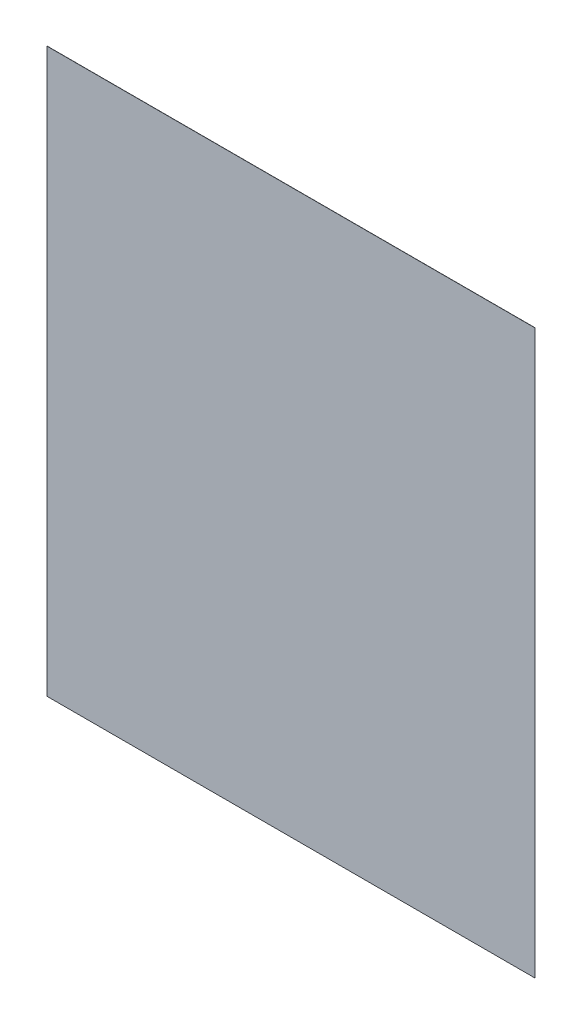
ISO-10303-21;
HEADER;
FILE_DESCRIPTION(('STEP AP214'),'2;1');
FILE_NAME('part.step','',(''),(''),'','','');
FILE_SCHEMA(('AUTOMOTIVE_DESIGN { 1 0 10303 214 1 1 1 1 }'));
ENDSEC;
DATA;
#1=APPLICATION_CONTEXT('core data for automotive mechanical design processes');
#2=APPLICATION_PROTOCOL_DEFINITION('international standard','automotive_design',2000,#1);
#3=PRODUCT_CONTEXT('',#1,'mechanical');
#4=PRODUCT('Part','Part','',(#3));
#5=PRODUCT_RELATED_PRODUCT_CATEGORY('part','',(#4));
#6=PRODUCT_DEFINITION_FORMATION('','',#4);
#7=PRODUCT_DEFINITION_CONTEXT('part definition',#1,'design');
#8=PRODUCT_DEFINITION('design','',#6,#7);
#9=PRODUCT_DEFINITION_SHAPE('','',#8);
#10=(LENGTH_UNIT() NAMED_UNIT(*) SI_UNIT(.MILLI.,.METRE.));
#11=(NAMED_UNIT(*) PLANE_ANGLE_UNIT() SI_UNIT($,.RADIAN.));
#12=(NAMED_UNIT(*) SI_UNIT($,.STERADIAN.) SOLID_ANGLE_UNIT());
#13=UNCERTAINTY_MEASURE_WITH_UNIT(LENGTH_MEASURE(1.E-05),#10,'distance_accuracy_value','');
#14=(GEOMETRIC_REPRESENTATION_CONTEXT(3) GLOBAL_UNCERTAINTY_ASSIGNED_CONTEXT((#13)) GLOBAL_UNIT_ASSIGNED_CONTEXT((#10,
#11,#12)) REPRESENTATION_CONTEXT('',''));
#15=CARTESIAN_POINT('',(0.,0.,0.));
#16=DIRECTION('',(0.,0.,1.));
#17=DIRECTION('',(1.,0.,0.));
#18=AXIS2_PLACEMENT_3D('',#15,#16,#17);
#19=CARTESIAN_POINT('',(-130.,-150.,0.1));
#20=DIRECTION('',(1.,0.,0.));
#21=DIRECTION('',(0.,0.,-1.));
#22=AXIS2_PLACEMENT_3D('',#19,#20,#21);
#23=PLANE('',#22);
#24=DIRECTION('',(0.,-1.,0.));
#25=VECTOR('',#24,1.);
#26=CARTESIAN_POINT('',(-130.,-150.,0.));
#27=LINE('',#26,#25);
#28=CARTESIAN_POINT('',(-130.,150.,0.));
#29=VERTEX_POINT('',#28);
#30=CARTESIAN_POINT('',(-130.,-150.,0.));
#31=VERTEX_POINT('',#30);
#32=EDGE_CURVE('E102',#29,#31,#27,.T.);
#33=ORIENTED_EDGE('',*,*,#32,.T.);
#34=DIRECTION('',(0.,0.,-1.));
#35=VECTOR('',#34,1.);
#36=CARTESIAN_POINT('',(-130.,-150.,0.1));
#37=LINE('',#36,#35);
#38=CARTESIAN_POINT('',(-130.,-150.,0.1));
#39=VERTEX_POINT('',#38);
#40=EDGE_CURVE('E11',#39,#31,#37,.T.);
#41=ORIENTED_EDGE('',*,*,#40,.F.);
#42=DIRECTION('',(0.,-1.,0.));
#43=VECTOR('',#42,1.);
#44=CARTESIAN_POINT('',(-130.,-150.,0.1));
#45=LINE('',#44,#43);
#46=CARTESIAN_POINT('',(-130.,150.,0.1));
#47=VERTEX_POINT('',#46);
#48=EDGE_CURVE('E90',#47,#39,#45,.T.);
#49=ORIENTED_EDGE('',*,*,#48,.F.);
#50=DIRECTION('',(0.,0.,-1.));
#51=VECTOR('',#50,1.);
#52=CARTESIAN_POINT('',(-130.,150.,0.1));
#53=LINE('',#52,#51);
#54=EDGE_CURVE('E98',#47,#29,#53,.T.);
#55=ORIENTED_EDGE('',*,*,#54,.T.);
#56=EDGE_LOOP('',(#33,#41,#49,#55));
#57=FACE_BOUND('',#56,.T.);
#58=ADVANCED_FACE('F39',(#57),#23,.F.);
#59=CARTESIAN_POINT('',(130.,-150.,0.1));
#60=DIRECTION('',(0.,1.,0.));
#61=DIRECTION('',(0.,0.,1.));
#62=AXIS2_PLACEMENT_3D('',#59,#60,#61);
#63=PLANE('',#62);
#64=DIRECTION('',(1.,0.,0.));
#65=VECTOR('',#64,1.);
#66=CARTESIAN_POINT('',(130.,-150.,0.));
#67=LINE('',#66,#65);
#68=CARTESIAN_POINT('',(130.,-150.,0.));
#69=VERTEX_POINT('',#68);
#70=EDGE_CURVE('E94',#31,#69,#67,.T.);
#71=ORIENTED_EDGE('',*,*,#70,.T.);
#72=DIRECTION('',(0.,0.,-1.));
#73=VECTOR('',#72,1.);
#74=CARTESIAN_POINT('',(130.,-150.,0.1));
#75=LINE('',#74,#73);
#76=CARTESIAN_POINT('',(130.,-150.,0.1));
#77=VERTEX_POINT('',#76);
#78=EDGE_CURVE('E47',#77,#69,#75,.T.);
#79=ORIENTED_EDGE('',*,*,#78,.F.);
#80=DIRECTION('',(1.,0.,0.));
#81=VECTOR('',#80,1.);
#82=CARTESIAN_POINT('',(130.,-150.,0.1));
#83=LINE('',#82,#81);
#84=EDGE_CURVE('E85',#39,#77,#83,.T.);
#85=ORIENTED_EDGE('',*,*,#84,.F.);
#86=ORIENTED_EDGE('',*,*,#40,.T.);
#87=EDGE_LOOP('',(#71,#79,#85,#86));
#88=FACE_BOUND('',#87,.T.);
#89=ADVANCED_FACE('F93',(#88),#63,.F.);
#90=CARTESIAN_POINT('',(130.,-150.,0.1));
#91=DIRECTION('',(-1.,0.,0.));
#92=DIRECTION('',(0.,0.,1.));
#93=AXIS2_PLACEMENT_3D('',#90,#91,#92);
#94=PLANE('',#93);
#95=DIRECTION('',(0.,1.,0.));
#96=VECTOR('',#95,1.);
#97=CARTESIAN_POINT('',(130.,-150.,0.));
#98=LINE('',#97,#96);
#99=CARTESIAN_POINT('',(130.,150.,0.));
#100=VERTEX_POINT('',#99);
#101=EDGE_CURVE('E72',#69,#100,#98,.T.);
#102=ORIENTED_EDGE('',*,*,#101,.T.);
#103=DIRECTION('',(0.,0.,-1.));
#104=VECTOR('',#103,1.);
#105=CARTESIAN_POINT('',(130.,150.,0.1));
#106=LINE('',#105,#104);
#107=CARTESIAN_POINT('',(130.,150.,0.1));
#108=VERTEX_POINT('',#107);
#109=EDGE_CURVE('E95',#108,#100,#106,.T.);
#110=ORIENTED_EDGE('',*,*,#109,.F.);
#111=DIRECTION('',(0.,1.,0.));
#112=VECTOR('',#111,1.);
#113=CARTESIAN_POINT('',(130.,-150.,0.1));
#114=LINE('',#113,#112);
#115=EDGE_CURVE('E88',#77,#108,#114,.T.);
#116=ORIENTED_EDGE('',*,*,#115,.F.);
#117=ORIENTED_EDGE('',*,*,#78,.T.);
#118=EDGE_LOOP('',(#102,#110,#116,#117));
#119=FACE_BOUND('',#118,.T.);
#120=ADVANCED_FACE('F96',(#119),#94,.F.);
#121=CARTESIAN_POINT('',(130.,150.,0.1));
#122=DIRECTION('',(0.,-1.,0.));
#123=DIRECTION('',(1.,0.,0.));
#124=AXIS2_PLACEMENT_3D('',#121,#122,#123);
#125=PLANE('',#124);
#126=DIRECTION('',(-1.,0.,0.));
#127=VECTOR('',#126,1.);
#128=CARTESIAN_POINT('',(130.,150.,0.));
#129=LINE('',#128,#127);
#130=EDGE_CURVE('E78',#100,#29,#129,.T.);
#131=ORIENTED_EDGE('',*,*,#130,.T.);
#132=ORIENTED_EDGE('',*,*,#54,.F.);
#133=DIRECTION('',(-1.,0.,0.));
#134=VECTOR('',#133,1.);
#135=CARTESIAN_POINT('',(130.,150.,0.1));
#136=LINE('',#135,#134);
#137=EDGE_CURVE('E55',#108,#47,#136,.T.);
#138=ORIENTED_EDGE('',*,*,#137,.F.);
#139=ORIENTED_EDGE('',*,*,#109,.T.);
#140=EDGE_LOOP('',(#131,#132,#138,#139));
#141=FACE_BOUND('',#140,.T.);
#142=ADVANCED_FACE('F109',(#141),#125,.F.);
#143=CARTESIAN_POINT('',(0.,0.,0.1));
#144=DIRECTION('',(0.,0.,1.));
#145=DIRECTION('',(1.,0.,0.));
#146=AXIS2_PLACEMENT_3D('',#143,#144,#145);
#147=PLANE('',#146);
#148=ORIENTED_EDGE('',*,*,#48,.T.);
#149=ORIENTED_EDGE('',*,*,#84,.T.);
#150=ORIENTED_EDGE('',*,*,#115,.T.);
#151=ORIENTED_EDGE('',*,*,#137,.T.);
#152=EDGE_LOOP('',(#148,#149,#150,#151));
#153=FACE_BOUND('',#152,.T.);
#154=ADVANCED_FACE('F86',(#153),#147,.T.);
#155=CARTESIAN_POINT('',(0.,0.,0.));
#156=DIRECTION('',(0.,0.,1.));
#157=DIRECTION('',(1.,0.,0.));
#158=AXIS2_PLACEMENT_3D('',#155,#156,#157);
#159=PLANE('',#158);
#160=ORIENTED_EDGE('',*,*,#32,.F.);
#161=ORIENTED_EDGE('',*,*,#130,.F.);
#162=ORIENTED_EDGE('',*,*,#101,.F.);
#163=ORIENTED_EDGE('',*,*,#70,.F.);
#164=EDGE_LOOP('',(#160,#161,#162,#163));
#165=FACE_BOUND('',#164,.T.);
#166=ADVANCED_FACE('F112',(#165),#159,.F.);
#167=CLOSED_SHELL('',(#58,#89,#120,#142,#154,#166));
#168=MANIFOLD_SOLID_BREP('B2',#167);
#169=ADVANCED_BREP_SHAPE_REPRESENTATION('',(#18,#168),#14);
#170=SHAPE_DEFINITION_REPRESENTATION(#9,#169);
ENDSEC;
END-ISO-10303-21;
